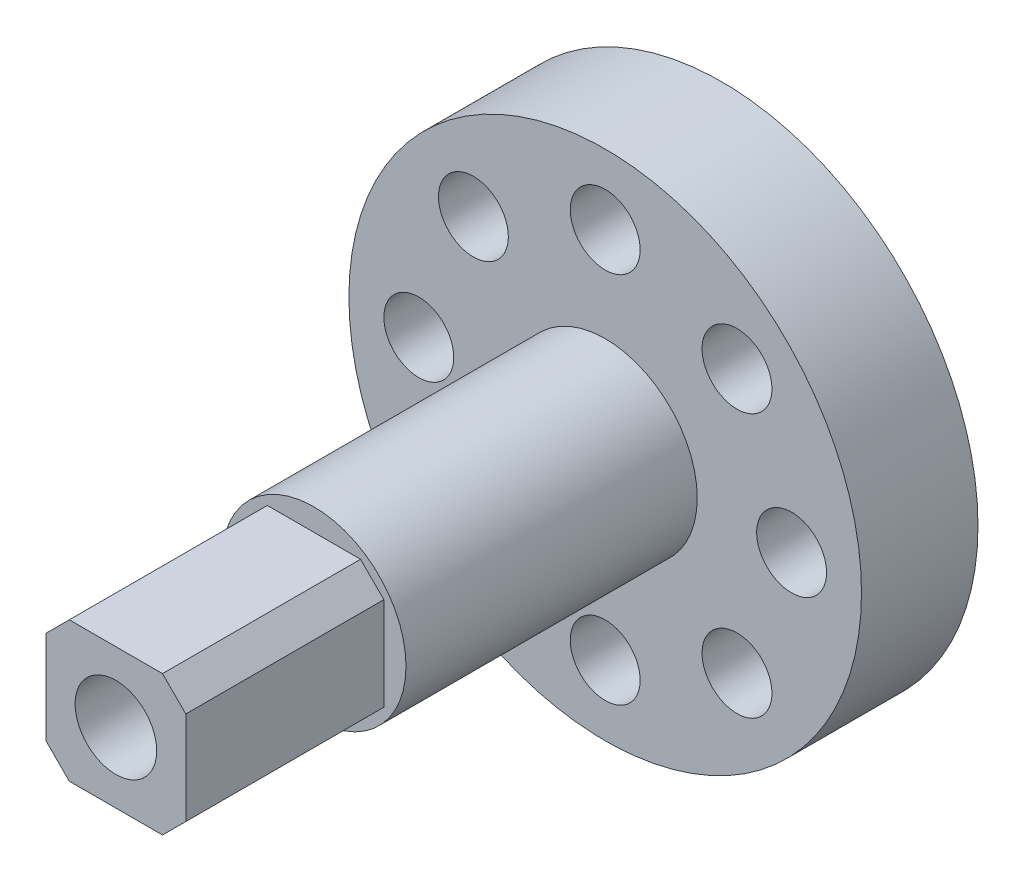
ISO-10303-21;
HEADER;
FILE_DESCRIPTION(('STEP AP214'),'2;1');
FILE_NAME('part.step','',(''),(''),'','','');
FILE_SCHEMA(('AUTOMOTIVE_DESIGN { 1 0 10303 214 1 1 1 1 }'));
ENDSEC;
DATA;
#1=APPLICATION_CONTEXT('core data for automotive mechanical design processes');
#2=APPLICATION_PROTOCOL_DEFINITION('international standard','automotive_design',2000,#1);
#3=PRODUCT_CONTEXT('',#1,'mechanical');
#4=PRODUCT('Part','Part','',(#3));
#5=PRODUCT_RELATED_PRODUCT_CATEGORY('part','',(#4));
#6=PRODUCT_DEFINITION_FORMATION('','',#4);
#7=PRODUCT_DEFINITION_CONTEXT('part definition',#1,'design');
#8=PRODUCT_DEFINITION('design','',#6,#7);
#9=PRODUCT_DEFINITION_SHAPE('','',#8);
#10=(LENGTH_UNIT() NAMED_UNIT(*) SI_UNIT(.MILLI.,.METRE.));
#11=(NAMED_UNIT(*) PLANE_ANGLE_UNIT() SI_UNIT($,.RADIAN.));
#12=(NAMED_UNIT(*) SI_UNIT($,.STERADIAN.) SOLID_ANGLE_UNIT());
#13=UNCERTAINTY_MEASURE_WITH_UNIT(LENGTH_MEASURE(1.E-05),#10,'distance_accuracy_value','');
#14=(GEOMETRIC_REPRESENTATION_CONTEXT(3) GLOBAL_UNCERTAINTY_ASSIGNED_CONTEXT((#13)) GLOBAL_UNIT_ASSIGNED_CONTEXT((#10,
#11,#12)) REPRESENTATION_CONTEXT('',''));
#15=CARTESIAN_POINT('',(0.,0.,0.));
#16=DIRECTION('',(0.,0.,1.));
#17=DIRECTION('',(1.,0.,0.));
#18=AXIS2_PLACEMENT_3D('',#15,#16,#17);
#19=CARTESIAN_POINT('',(0.,0.,5.));
#20=DIRECTION('',(0.,0.,1.));
#21=DIRECTION('',(1.,0.,0.));
#22=AXIS2_PLACEMENT_3D('',#19,#20,#21);
#23=PLANE('',#22);
#24=CARTESIAN_POINT('',(0.,0.,5.));
#25=DIRECTION('',(0.,0.,1.));
#26=DIRECTION('',(1.,0.,0.));
#27=AXIS2_PLACEMENT_3D('',#24,#25,#26);
#28=CIRCLE('',#27,3.95);
#29=CARTESIAN_POINT('',(3.95,0.,5.));
#30=VERTEX_POINT('',#29);
#31=EDGE_CURVE('E530',#30,#30,#28,.T.);
#32=ORIENTED_EDGE('',*,*,#31,.F.);
#33=EDGE_LOOP('',(#32));
#34=FACE_BOUND('',#33,.T.);
#35=CARTESIAN_POINT('',(5.65685424949238,-5.65685424949238,5.));
#36=DIRECTION('',(0.,0.,1.));
#37=DIRECTION('',(1.,0.,0.));
#38=AXIS2_PLACEMENT_3D('',#35,#36,#37);
#39=CIRCLE('',#38,1.5);
#40=CARTESIAN_POINT('',(7.15685424949238,-5.65685424949238,5.));
#41=VERTEX_POINT('',#40);
#42=EDGE_CURVE('E172',#41,#41,#39,.T.);
#43=ORIENTED_EDGE('',*,*,#42,.F.);
#44=EDGE_LOOP('',(#43));
#45=FACE_BOUND('',#44,.T.);
#46=CARTESIAN_POINT('',(0.,-8.,5.));
#47=DIRECTION('',(0.,0.,1.));
#48=DIRECTION('',(1.,0.,0.));
#49=AXIS2_PLACEMENT_3D('',#46,#47,#48);
#50=CIRCLE('',#49,1.5);
#51=CARTESIAN_POINT('',(1.5,-8.,5.));
#52=VERTEX_POINT('',#51);
#53=EDGE_CURVE('E202',#52,#52,#50,.T.);
#54=ORIENTED_EDGE('',*,*,#53,.F.);
#55=EDGE_LOOP('',(#54));
#56=FACE_BOUND('',#55,.T.);
#57=CARTESIAN_POINT('',(-5.65685424949238,-5.65685424949238,5.));
#58=DIRECTION('',(0.,0.,1.));
#59=DIRECTION('',(1.,0.,0.));
#60=AXIS2_PLACEMENT_3D('',#57,#58,#59);
#61=CIRCLE('',#60,1.5);
#62=CARTESIAN_POINT('',(-4.15685424949238,-5.65685424949238,5.));
#63=VERTEX_POINT('',#62);
#64=EDGE_CURVE('E199',#63,#63,#61,.T.);
#65=ORIENTED_EDGE('',*,*,#64,.F.);
#66=EDGE_LOOP('',(#65));
#67=FACE_BOUND('',#66,.T.);
#68=CARTESIAN_POINT('',(-8.,0.,5.));
#69=DIRECTION('',(0.,0.,1.));
#70=DIRECTION('',(1.,0.,0.));
#71=AXIS2_PLACEMENT_3D('',#68,#69,#70);
#72=CIRCLE('',#71,1.5);
#73=CARTESIAN_POINT('',(-6.5,0.,5.));
#74=VERTEX_POINT('',#73);
#75=EDGE_CURVE('E196',#74,#74,#72,.T.);
#76=ORIENTED_EDGE('',*,*,#75,.F.);
#77=EDGE_LOOP('',(#76));
#78=FACE_BOUND('',#77,.T.);
#79=CARTESIAN_POINT('',(-5.65685424949238,5.65685424949238,5.));
#80=DIRECTION('',(0.,0.,1.));
#81=DIRECTION('',(1.,0.,0.));
#82=AXIS2_PLACEMENT_3D('',#79,#80,#81);
#83=CIRCLE('',#82,1.5);
#84=CARTESIAN_POINT('',(-4.15685424949238,5.65685424949238,5.));
#85=VERTEX_POINT('',#84);
#86=EDGE_CURVE('E193',#85,#85,#83,.T.);
#87=ORIENTED_EDGE('',*,*,#86,.F.);
#88=EDGE_LOOP('',(#87));
#89=FACE_BOUND('',#88,.T.);
#90=CARTESIAN_POINT('',(0.,8.,5.));
#91=DIRECTION('',(0.,0.,1.));
#92=DIRECTION('',(1.,0.,0.));
#93=AXIS2_PLACEMENT_3D('',#90,#91,#92);
#94=CIRCLE('',#93,1.5);
#95=CARTESIAN_POINT('',(1.5,8.,5.));
#96=VERTEX_POINT('',#95);
#97=EDGE_CURVE('E190',#96,#96,#94,.T.);
#98=ORIENTED_EDGE('',*,*,#97,.F.);
#99=EDGE_LOOP('',(#98));
#100=FACE_BOUND('',#99,.T.);
#101=CARTESIAN_POINT('',(5.65685424949238,5.65685424949238,5.));
#102=DIRECTION('',(0.,0.,1.));
#103=DIRECTION('',(1.,0.,0.));
#104=AXIS2_PLACEMENT_3D('',#101,#102,#103);
#105=CIRCLE('',#104,1.5);
#106=CARTESIAN_POINT('',(7.15685424949238,5.65685424949238,5.));
#107=VERTEX_POINT('',#106);
#108=EDGE_CURVE('E150',#107,#107,#105,.T.);
#109=ORIENTED_EDGE('',*,*,#108,.F.);
#110=EDGE_LOOP('',(#109));
#111=FACE_BOUND('',#110,.T.);
#112=CARTESIAN_POINT('',(8.,0.,5.));
#113=DIRECTION('',(0.,0.,1.));
#114=DIRECTION('',(1.,0.,0.));
#115=AXIS2_PLACEMENT_3D('',#112,#113,#114);
#116=CIRCLE('',#115,1.5);
#117=CARTESIAN_POINT('',(9.5,0.,5.));
#118=VERTEX_POINT('',#117);
#119=EDGE_CURVE('E171',#118,#118,#116,.T.);
#120=ORIENTED_EDGE('',*,*,#119,.F.);
#121=EDGE_LOOP('',(#120));
#122=FACE_BOUND('',#121,.T.);
#123=CARTESIAN_POINT('',(0.,0.,5.));
#124=DIRECTION('',(0.,0.,1.));
#125=DIRECTION('',(1.,0.,0.));
#126=AXIS2_PLACEMENT_3D('',#123,#124,#125);
#127=CIRCLE('',#126,11.);
#128=CARTESIAN_POINT('',(11.,0.,5.));
#129=VERTEX_POINT('',#128);
#130=EDGE_CURVE('E173',#129,#129,#127,.T.);
#131=ORIENTED_EDGE('',*,*,#130,.T.);
#132=EDGE_LOOP('',(#131));
#133=FACE_BOUND('',#132,.T.);
#134=ADVANCED_FACE('F33',(#34,#45,#56,#67,#78,#89,#100,#111,#122,#133),#23,.T.);
#135=CARTESIAN_POINT('',(0.,0.,0.));
#136=DIRECTION('',(0.,0.,1.));
#137=DIRECTION('',(1.,0.,0.));
#138=AXIS2_PLACEMENT_3D('',#135,#136,#137);
#139=PLANE('',#138);
#140=CARTESIAN_POINT('',(5.65685424949238,-5.65685424949238,0.));
#141=DIRECTION('',(0.,0.,1.));
#142=DIRECTION('',(1.,0.,0.));
#143=AXIS2_PLACEMENT_3D('',#140,#141,#142);
#144=CIRCLE('',#143,1.5);
#145=CARTESIAN_POINT('',(7.15685424949238,-5.65685424949238,0.));
#146=VERTEX_POINT('',#145);
#147=EDGE_CURVE('E147',#146,#146,#144,.T.);
#148=ORIENTED_EDGE('',*,*,#147,.T.);
#149=EDGE_LOOP('',(#148));
#150=FACE_BOUND('',#149,.T.);
#151=CARTESIAN_POINT('',(0.,-8.,0.));
#152=DIRECTION('',(0.,0.,1.));
#153=DIRECTION('',(1.,0.,0.));
#154=AXIS2_PLACEMENT_3D('',#151,#152,#153);
#155=CIRCLE('',#154,1.5);
#156=CARTESIAN_POINT('',(1.5,-8.,0.));
#157=VERTEX_POINT('',#156);
#158=EDGE_CURVE('E151',#157,#157,#155,.T.);
#159=ORIENTED_EDGE('',*,*,#158,.T.);
#160=EDGE_LOOP('',(#159));
#161=FACE_BOUND('',#160,.T.);
#162=CARTESIAN_POINT('',(-5.65685424949238,-5.65685424949238,0.));
#163=DIRECTION('',(0.,0.,1.));
#164=DIRECTION('',(1.,0.,0.));
#165=AXIS2_PLACEMENT_3D('',#162,#163,#164);
#166=CIRCLE('',#165,1.5);
#167=CARTESIAN_POINT('',(-4.15685424949238,-5.65685424949238,0.));
#168=VERTEX_POINT('',#167);
#169=EDGE_CURVE('E154',#168,#168,#166,.T.);
#170=ORIENTED_EDGE('',*,*,#169,.T.);
#171=EDGE_LOOP('',(#170));
#172=FACE_BOUND('',#171,.T.);
#173=CARTESIAN_POINT('',(-8.,0.,0.));
#174=DIRECTION('',(0.,0.,1.));
#175=DIRECTION('',(1.,0.,0.));
#176=AXIS2_PLACEMENT_3D('',#173,#174,#175);
#177=CIRCLE('',#176,1.5);
#178=CARTESIAN_POINT('',(-6.5,0.,0.));
#179=VERTEX_POINT('',#178);
#180=EDGE_CURVE('E157',#179,#179,#177,.T.);
#181=ORIENTED_EDGE('',*,*,#180,.T.);
#182=EDGE_LOOP('',(#181));
#183=FACE_BOUND('',#182,.T.);
#184=CARTESIAN_POINT('',(-5.65685424949238,5.65685424949238,0.));
#185=DIRECTION('',(0.,0.,1.));
#186=DIRECTION('',(1.,0.,0.));
#187=AXIS2_PLACEMENT_3D('',#184,#185,#186);
#188=CIRCLE('',#187,1.5);
#189=CARTESIAN_POINT('',(-4.15685424949238,5.65685424949238,0.));
#190=VERTEX_POINT('',#189);
#191=EDGE_CURVE('E160',#190,#190,#188,.T.);
#192=ORIENTED_EDGE('',*,*,#191,.T.);
#193=EDGE_LOOP('',(#192));
#194=FACE_BOUND('',#193,.T.);
#195=CARTESIAN_POINT('',(0.,8.,0.));
#196=DIRECTION('',(0.,0.,1.));
#197=DIRECTION('',(1.,0.,0.));
#198=AXIS2_PLACEMENT_3D('',#195,#196,#197);
#199=CIRCLE('',#198,1.5);
#200=CARTESIAN_POINT('',(1.5,8.,0.));
#201=VERTEX_POINT('',#200);
#202=EDGE_CURVE('E163',#201,#201,#199,.T.);
#203=ORIENTED_EDGE('',*,*,#202,.T.);
#204=EDGE_LOOP('',(#203));
#205=FACE_BOUND('',#204,.T.);
#206=CARTESIAN_POINT('',(5.65685424949238,5.65685424949238,0.));
#207=DIRECTION('',(0.,0.,1.));
#208=DIRECTION('',(1.,0.,0.));
#209=AXIS2_PLACEMENT_3D('',#206,#207,#208);
#210=CIRCLE('',#209,1.5);
#211=CARTESIAN_POINT('',(7.15685424949238,5.65685424949238,0.));
#212=VERTEX_POINT('',#211);
#213=EDGE_CURVE('E146',#212,#212,#210,.T.);
#214=ORIENTED_EDGE('',*,*,#213,.T.);
#215=EDGE_LOOP('',(#214));
#216=FACE_BOUND('',#215,.T.);
#217=CARTESIAN_POINT('',(8.,0.,0.));
#218=DIRECTION('',(0.,0.,1.));
#219=DIRECTION('',(1.,0.,0.));
#220=AXIS2_PLACEMENT_3D('',#217,#218,#219);
#221=CIRCLE('',#220,1.5);
#222=CARTESIAN_POINT('',(9.5,0.,0.));
#223=VERTEX_POINT('',#222);
#224=EDGE_CURVE('E168',#223,#223,#221,.T.);
#225=ORIENTED_EDGE('',*,*,#224,.T.);
#226=EDGE_LOOP('',(#225));
#227=FACE_BOUND('',#226,.T.);
#228=CARTESIAN_POINT('',(0.,0.,0.));
#229=DIRECTION('',(0.,0.,1.));
#230=DIRECTION('',(1.,0.,0.));
#231=AXIS2_PLACEMENT_3D('',#228,#229,#230);
#232=CIRCLE('',#231,11.);
#233=CARTESIAN_POINT('',(11.,0.,0.));
#234=VERTEX_POINT('',#233);
#235=EDGE_CURVE('E182',#234,#234,#232,.T.);
#236=ORIENTED_EDGE('',*,*,#235,.F.);
#237=EDGE_LOOP('',(#236));
#238=FACE_BOUND('',#237,.T.);
#239=CARTESIAN_POINT('',(0.,0.,0.));
#240=DIRECTION('',(0.,0.,1.));
#241=DIRECTION('',(1.,0.,0.));
#242=AXIS2_PLACEMENT_3D('',#239,#240,#241);
#243=CIRCLE('',#242,4.5);
#244=CARTESIAN_POINT('',(4.5,0.,0.));
#245=VERTEX_POINT('',#244);
#246=EDGE_CURVE('E179',#245,#245,#243,.T.);
#247=ORIENTED_EDGE('',*,*,#246,.T.);
#248=EDGE_LOOP('',(#247));
#249=FACE_BOUND('',#248,.T.);
#250=ADVANCED_FACE('F258',(#150,#161,#172,#183,#194,#205,#216,#227,#238,#249),#139,.F.);
#251=CARTESIAN_POINT('',(0.,0.,4.));
#252=DIRECTION('',(0.,0.,-1.));
#253=DIRECTION('',(-1.,0.,0.));
#254=AXIS2_PLACEMENT_3D('',#251,#252,#253);
#255=CYLINDRICAL_SURFACE('',#254,11.);
#256=ORIENTED_EDGE('',*,*,#235,.T.);
#257=EDGE_LOOP('',(#256));
#258=FACE_BOUND('',#257,.T.);
#259=ORIENTED_EDGE('',*,*,#130,.F.);
#260=EDGE_LOOP('',(#259));
#261=FACE_BOUND('',#260,.T.);
#262=ADVANCED_FACE('F264',(#258,#261),#255,.T.);
#263=CARTESIAN_POINT('',(0.,0.,4.));
#264=DIRECTION('',(0.,0.,-1.));
#265=DIRECTION('',(-1.,0.,0.));
#266=AXIS2_PLACEMENT_3D('',#263,#264,#265);
#267=CYLINDRICAL_SURFACE('',#266,4.5);
#268=CARTESIAN_POINT('',(0.,0.,4.));
#269=DIRECTION('',(0.,0.,1.));
#270=DIRECTION('',(1.,0.,0.));
#271=AXIS2_PLACEMENT_3D('',#268,#269,#270);
#272=CIRCLE('',#271,4.5);
#273=CARTESIAN_POINT('',(4.5,0.,4.));
#274=VERTEX_POINT('',#273);
#275=EDGE_CURVE('E176',#274,#274,#272,.T.);
#276=ORIENTED_EDGE('',*,*,#275,.T.);
#277=EDGE_LOOP('',(#276));
#278=FACE_BOUND('',#277,.T.);
#279=ORIENTED_EDGE('',*,*,#246,.F.);
#280=EDGE_LOOP('',(#279));
#281=FACE_BOUND('',#280,.T.);
#282=ADVANCED_FACE('F276',(#278,#281),#267,.F.);
#283=CARTESIAN_POINT('',(0.,0.,4.));
#284=DIRECTION('',(0.,0.,1.));
#285=DIRECTION('',(1.,0.,0.));
#286=AXIS2_PLACEMENT_3D('',#283,#284,#285);
#287=PLANE('',#286);
#288=CARTESIAN_POINT('',(0.,0.,4.));
#289=DIRECTION('',(0.,0.,1.));
#290=DIRECTION('',(1.,0.,0.));
#291=AXIS2_PLACEMENT_3D('',#288,#289,#290);
#292=CIRCLE('',#291,1.75);
#293=CARTESIAN_POINT('',(1.75,0.,4.));
#294=VERTEX_POINT('',#293);
#295=EDGE_CURVE('E531',#294,#294,#292,.T.);
#296=ORIENTED_EDGE('',*,*,#295,.T.);
#297=EDGE_LOOP('',(#296));
#298=FACE_BOUND('',#297,.T.);
#299=ORIENTED_EDGE('',*,*,#275,.F.);
#300=EDGE_LOOP('',(#299));
#301=FACE_BOUND('',#300,.T.);
#302=ADVANCED_FACE('F273',(#298,#301),#287,.F.);
#303=CARTESIAN_POINT('',(8.,0.,0.));
#304=DIRECTION('',(0.,0.,1.));
#305=DIRECTION('',(1.,0.,0.));
#306=AXIS2_PLACEMENT_3D('',#303,#304,#305);
#307=CYLINDRICAL_SURFACE('',#306,1.5);
#308=ORIENTED_EDGE('',*,*,#119,.T.);
#309=EDGE_LOOP('',(#308));
#310=FACE_BOUND('',#309,.T.);
#311=ORIENTED_EDGE('',*,*,#224,.F.);
#312=EDGE_LOOP('',(#311));
#313=FACE_BOUND('',#312,.T.);
#314=ADVANCED_FACE('F271',(#310,#313),#307,.F.);
#315=CARTESIAN_POINT('',(5.65685424949238,5.65685424949238,0.));
#316=DIRECTION('',(0.,0.,1.));
#317=DIRECTION('',(1.,0.,0.));
#318=AXIS2_PLACEMENT_3D('',#315,#316,#317);
#319=CYLINDRICAL_SURFACE('',#318,1.5);
#320=ORIENTED_EDGE('',*,*,#108,.T.);
#321=EDGE_LOOP('',(#320));
#322=FACE_BOUND('',#321,.T.);
#323=ORIENTED_EDGE('',*,*,#213,.F.);
#324=EDGE_LOOP('',(#323));
#325=FACE_BOUND('',#324,.T.);
#326=ADVANCED_FACE('F440',(#322,#325),#319,.F.);
#327=CARTESIAN_POINT('',(0.,8.,0.));
#328=DIRECTION('',(0.,0.,1.));
#329=DIRECTION('',(1.,0.,0.));
#330=AXIS2_PLACEMENT_3D('',#327,#328,#329);
#331=CYLINDRICAL_SURFACE('',#330,1.5);
#332=ORIENTED_EDGE('',*,*,#97,.T.);
#333=EDGE_LOOP('',(#332));
#334=FACE_BOUND('',#333,.T.);
#335=ORIENTED_EDGE('',*,*,#202,.F.);
#336=EDGE_LOOP('',(#335));
#337=FACE_BOUND('',#336,.T.);
#338=ADVANCED_FACE('F430',(#334,#337),#331,.F.);
#339=CARTESIAN_POINT('',(-5.65685424949238,5.65685424949238,0.));
#340=DIRECTION('',(0.,0.,1.));
#341=DIRECTION('',(1.,0.,0.));
#342=AXIS2_PLACEMENT_3D('',#339,#340,#341);
#343=CYLINDRICAL_SURFACE('',#342,1.5);
#344=ORIENTED_EDGE('',*,*,#86,.T.);
#345=EDGE_LOOP('',(#344));
#346=FACE_BOUND('',#345,.T.);
#347=ORIENTED_EDGE('',*,*,#191,.F.);
#348=EDGE_LOOP('',(#347));
#349=FACE_BOUND('',#348,.T.);
#350=ADVANCED_FACE('F420',(#346,#349),#343,.F.);
#351=CARTESIAN_POINT('',(-8.,0.,0.));
#352=DIRECTION('',(0.,0.,1.));
#353=DIRECTION('',(1.,0.,0.));
#354=AXIS2_PLACEMENT_3D('',#351,#352,#353);
#355=CYLINDRICAL_SURFACE('',#354,1.5);
#356=ORIENTED_EDGE('',*,*,#75,.T.);
#357=EDGE_LOOP('',(#356));
#358=FACE_BOUND('',#357,.T.);
#359=ORIENTED_EDGE('',*,*,#180,.F.);
#360=EDGE_LOOP('',(#359));
#361=FACE_BOUND('',#360,.T.);
#362=ADVANCED_FACE('F410',(#358,#361),#355,.F.);
#363=CARTESIAN_POINT('',(-5.65685424949238,-5.65685424949238,0.));
#364=DIRECTION('',(0.,0.,1.));
#365=DIRECTION('',(1.,0.,0.));
#366=AXIS2_PLACEMENT_3D('',#363,#364,#365);
#367=CYLINDRICAL_SURFACE('',#366,1.5);
#368=ORIENTED_EDGE('',*,*,#64,.T.);
#369=EDGE_LOOP('',(#368));
#370=FACE_BOUND('',#369,.T.);
#371=ORIENTED_EDGE('',*,*,#169,.F.);
#372=EDGE_LOOP('',(#371));
#373=FACE_BOUND('',#372,.T.);
#374=ADVANCED_FACE('F400',(#370,#373),#367,.F.);
#375=CARTESIAN_POINT('',(0.,-8.,0.));
#376=DIRECTION('',(0.,0.,1.));
#377=DIRECTION('',(1.,0.,0.));
#378=AXIS2_PLACEMENT_3D('',#375,#376,#377);
#379=CYLINDRICAL_SURFACE('',#378,1.5);
#380=ORIENTED_EDGE('',*,*,#53,.T.);
#381=EDGE_LOOP('',(#380));
#382=FACE_BOUND('',#381,.T.);
#383=ORIENTED_EDGE('',*,*,#158,.F.);
#384=EDGE_LOOP('',(#383));
#385=FACE_BOUND('',#384,.T.);
#386=ADVANCED_FACE('F391',(#382,#385),#379,.F.);
#387=CARTESIAN_POINT('',(5.65685424949238,-5.65685424949238,0.));
#388=DIRECTION('',(0.,0.,1.));
#389=DIRECTION('',(1.,0.,0.));
#390=AXIS2_PLACEMENT_3D('',#387,#388,#389);
#391=CYLINDRICAL_SURFACE('',#390,1.5);
#392=ORIENTED_EDGE('',*,*,#42,.T.);
#393=EDGE_LOOP('',(#392));
#394=FACE_BOUND('',#393,.T.);
#395=ORIENTED_EDGE('',*,*,#147,.F.);
#396=EDGE_LOOP('',(#395));
#397=FACE_BOUND('',#396,.T.);
#398=ADVANCED_FACE('F359',(#394,#397),#391,.F.);
#399=CARTESIAN_POINT('',(0.,0.,17.5));
#400=DIRECTION('',(0.,0.,-1.));
#401=DIRECTION('',(-1.,0.,0.));
#402=AXIS2_PLACEMENT_3D('',#399,#400,#401);
#403=CYLINDRICAL_SURFACE('',#402,3.95);
#404=CARTESIAN_POINT('',(0.,0.,17.5));
#405=DIRECTION('',(0.,0.,1.));
#406=DIRECTION('',(1.,0.,0.));
#407=AXIS2_PLACEMENT_3D('',#404,#405,#406);
#408=CIRCLE('',#407,3.95);
#409=CARTESIAN_POINT('',(3.95,0.,17.5));
#410=VERTEX_POINT('',#409);
#411=EDGE_CURVE('E116',#410,#410,#408,.T.);
#412=ORIENTED_EDGE('',*,*,#411,.F.);
#413=EDGE_LOOP('',(#412));
#414=FACE_BOUND('',#413,.T.);
#415=ORIENTED_EDGE('',*,*,#31,.T.);
#416=EDGE_LOOP('',(#415));
#417=FACE_BOUND('',#416,.T.);
#418=ADVANCED_FACE('F301',(#414,#417),#403,.T.);
#419=CARTESIAN_POINT('',(0.,0.,17.5));
#420=DIRECTION('',(0.,0.,1.));
#421=DIRECTION('',(1.,0.,0.));
#422=AXIS2_PLACEMENT_3D('',#419,#420,#421);
#423=PLANE('',#422);
#424=DIRECTION('',(0.,1.,0.));
#425=VECTOR('',#424,1.);
#426=CARTESIAN_POINT('',(3.,3.,17.5));
#427=LINE('',#426,#425);
#428=CARTESIAN_POINT('',(3.,-2.00000000000001,17.5));
#429=VERTEX_POINT('',#428);
#430=CARTESIAN_POINT('',(3.,2.,17.5));
#431=VERTEX_POINT('',#430);
#432=EDGE_CURVE('E128',#429,#431,#427,.T.);
#433=ORIENTED_EDGE('',*,*,#432,.F.);
#434=DIRECTION('',(0.707106781186549,0.707106781186546,0.));
#435=VECTOR('',#434,1.);
#436=CARTESIAN_POINT('',(3.,-2.00000000000001,17.5));
#437=LINE('',#436,#435);
#438=CARTESIAN_POINT('',(2.,-3.,17.5));
#439=VERTEX_POINT('',#438);
#440=EDGE_CURVE('E132',#429,#439,#437,.F.);
#441=ORIENTED_EDGE('',*,*,#440,.T.);
#442=DIRECTION('',(1.,0.,0.));
#443=VECTOR('',#442,1.);
#444=CARTESIAN_POINT('',(-3.,-3.,17.5));
#445=LINE('',#444,#443);
#446=CARTESIAN_POINT('',(-2.00000000000001,-3.,17.5));
#447=VERTEX_POINT('',#446);
#448=EDGE_CURVE('E130',#447,#439,#445,.T.);
#449=ORIENTED_EDGE('',*,*,#448,.F.);
#450=DIRECTION('',(0.707106781186546,-0.707106781186549,0.));
#451=VECTOR('',#450,1.);
#452=CARTESIAN_POINT('',(-2.00000000000001,-3.,17.5));
#453=LINE('',#452,#451);
#454=CARTESIAN_POINT('',(-3.,-2.,17.5));
#455=VERTEX_POINT('',#454);
#456=EDGE_CURVE('E49',#447,#455,#453,.F.);
#457=ORIENTED_EDGE('',*,*,#456,.T.);
#458=DIRECTION('',(0.,-1.,0.));
#459=VECTOR('',#458,1.);
#460=CARTESIAN_POINT('',(-3.,3.,17.5));
#461=LINE('',#460,#459);
#462=CARTESIAN_POINT('',(-3.,2.00000000000001,17.5));
#463=VERTEX_POINT('',#462);
#464=EDGE_CURVE('E57',#463,#455,#461,.T.);
#465=ORIENTED_EDGE('',*,*,#464,.F.);
#466=DIRECTION('',(-0.707106781186549,-0.707106781186546,0.));
#467=VECTOR('',#466,1.);
#468=CARTESIAN_POINT('',(-3.,2.00000000000001,17.5));
#469=LINE('',#468,#467);
#470=CARTESIAN_POINT('',(-2.,3.,17.5));
#471=VERTEX_POINT('',#470);
#472=EDGE_CURVE('E11',#463,#471,#469,.F.);
#473=ORIENTED_EDGE('',*,*,#472,.T.);
#474=DIRECTION('',(-1.,0.,0.));
#475=VECTOR('',#474,1.);
#476=CARTESIAN_POINT('',(-3.,3.,17.5));
#477=LINE('',#476,#475);
#478=CARTESIAN_POINT('',(2.00000000000001,3.,17.5));
#479=VERTEX_POINT('',#478);
#480=EDGE_CURVE('E111',#479,#471,#477,.T.);
#481=ORIENTED_EDGE('',*,*,#480,.F.);
#482=DIRECTION('',(-0.707106781186547,0.707106781186548,0.));
#483=VECTOR('',#482,1.);
#484=CARTESIAN_POINT('',(2.00000000000001,3.,17.5));
#485=LINE('',#484,#483);
#486=EDGE_CURVE('E122',#479,#431,#485,.F.);
#487=ORIENTED_EDGE('',*,*,#486,.T.);
#488=EDGE_LOOP('',(#433,#441,#449,#457,#465,#473,#481,#487));
#489=FACE_BOUND('',#488,.T.);
#490=ORIENTED_EDGE('',*,*,#411,.T.);
#491=EDGE_LOOP('',(#490));
#492=FACE_BOUND('',#491,.T.);
#493=ADVANCED_FACE('F119',(#489,#492),#423,.T.);
#494=CARTESIAN_POINT('',(0.,0.,26.));
#495=DIRECTION('',(0.,0.,1.));
#496=DIRECTION('',(1.,0.,0.));
#497=AXIS2_PLACEMENT_3D('',#494,#495,#496);
#498=PLANE('',#497);
#499=CARTESIAN_POINT('',(0.,0.,26.));
#500=DIRECTION('',(0.,0.,1.));
#501=DIRECTION('',(1.,0.,0.));
#502=AXIS2_PLACEMENT_3D('',#499,#500,#501);
#503=CIRCLE('',#502,1.75);
#504=CARTESIAN_POINT('',(1.75,0.,26.));
#505=VERTEX_POINT('',#504);
#506=EDGE_CURVE('E37',#505,#505,#503,.T.);
#507=ORIENTED_EDGE('',*,*,#506,.F.);
#508=EDGE_LOOP('',(#507));
#509=FACE_BOUND('',#508,.T.);
#510=DIRECTION('',(0.,-1.,0.));
#511=VECTOR('',#510,1.);
#512=CARTESIAN_POINT('',(-3.,3.,26.));
#513=LINE('',#512,#511);
#514=CARTESIAN_POINT('',(-3.,2.00000000000001,26.));
#515=VERTEX_POINT('',#514);
#516=CARTESIAN_POINT('',(-3.,-2.,26.));
#517=VERTEX_POINT('',#516);
#518=EDGE_CURVE('E135',#515,#517,#513,.T.);
#519=ORIENTED_EDGE('',*,*,#518,.T.);
#520=DIRECTION('',(-0.707106781186546,0.707106781186549,0.));
#521=VECTOR('',#520,1.);
#522=CARTESIAN_POINT('',(-2.50000000000001,-2.5,26.));
#523=LINE('',#522,#521);
#524=CARTESIAN_POINT('',(-2.00000000000001,-3.,26.));
#525=VERTEX_POINT('',#524);
#526=EDGE_CURVE('E219',#517,#525,#523,.F.);
#527=ORIENTED_EDGE('',*,*,#526,.T.);
#528=DIRECTION('',(1.,0.,0.));
#529=VECTOR('',#528,1.);
#530=CARTESIAN_POINT('',(-3.,-3.,26.));
#531=LINE('',#530,#529);
#532=CARTESIAN_POINT('',(2.,-3.,26.));
#533=VERTEX_POINT('',#532);
#534=EDGE_CURVE('E138',#525,#533,#531,.T.);
#535=ORIENTED_EDGE('',*,*,#534,.T.);
#536=DIRECTION('',(-0.707106781186549,-0.707106781186546,0.));
#537=VECTOR('',#536,1.);
#538=CARTESIAN_POINT('',(2.5,-2.50000000000001,26.));
#539=LINE('',#538,#537);
#540=CARTESIAN_POINT('',(3.,-2.00000000000001,26.));
#541=VERTEX_POINT('',#540);
#542=EDGE_CURVE('E217',#533,#541,#539,.F.);
#543=ORIENTED_EDGE('',*,*,#542,.T.);
#544=DIRECTION('',(0.,1.,0.));
#545=VECTOR('',#544,1.);
#546=CARTESIAN_POINT('',(3.,3.,26.));
#547=LINE('',#546,#545);
#548=CARTESIAN_POINT('',(3.,2.,26.));
#549=VERTEX_POINT('',#548);
#550=EDGE_CURVE('E141',#541,#549,#547,.T.);
#551=ORIENTED_EDGE('',*,*,#550,.T.);
#552=DIRECTION('',(0.707106781186547,-0.707106781186548,0.));
#553=VECTOR('',#552,1.);
#554=CARTESIAN_POINT('',(2.5,2.5,26.));
#555=LINE('',#554,#553);
#556=CARTESIAN_POINT('',(2.00000000000001,3.,26.));
#557=VERTEX_POINT('',#556);
#558=EDGE_CURVE('E215',#549,#557,#555,.F.);
#559=ORIENTED_EDGE('',*,*,#558,.T.);
#560=DIRECTION('',(-1.,0.,0.));
#561=VECTOR('',#560,1.);
#562=CARTESIAN_POINT('',(-3.,3.,26.));
#563=LINE('',#562,#561);
#564=CARTESIAN_POINT('',(-2.,3.,26.));
#565=VERTEX_POINT('',#564);
#566=EDGE_CURVE('E144',#557,#565,#563,.T.);
#567=ORIENTED_EDGE('',*,*,#566,.T.);
#568=DIRECTION('',(0.707106781186549,0.707106781186546,0.));
#569=VECTOR('',#568,1.);
#570=CARTESIAN_POINT('',(-2.5,2.50000000000001,26.));
#571=LINE('',#570,#569);
#572=EDGE_CURVE('E103',#565,#515,#571,.F.);
#573=ORIENTED_EDGE('',*,*,#572,.T.);
#574=EDGE_LOOP('',(#519,#527,#535,#543,#551,#559,#567,#573));
#575=FACE_BOUND('',#574,.T.);
#576=ADVANCED_FACE('F236',(#509,#575),#498,.T.);
#577=CARTESIAN_POINT('',(-3.,2.00000000000001,26.));
#578=DIRECTION('',(0.707106781186546,-0.707106781186549,0.));
#579=DIRECTION('',(0.,0.,-1.));
#580=AXIS2_PLACEMENT_3D('',#577,#578,#579);
#581=PLANE('',#580);
#582=ORIENTED_EDGE('',*,*,#472,.F.);
#583=DIRECTION('',(0.,0.,-1.));
#584=VECTOR('',#583,1.);
#585=CARTESIAN_POINT('',(-3.,2.00000000000001,26.));
#586=LINE('',#585,#584);
#587=EDGE_CURVE('E210',#515,#463,#586,.T.);
#588=ORIENTED_EDGE('',*,*,#587,.F.);
#589=ORIENTED_EDGE('',*,*,#572,.F.);
#590=DIRECTION('',(0.,0.,1.));
#591=VECTOR('',#590,1.);
#592=CARTESIAN_POINT('',(-2.,3.,26.));
#593=LINE('',#592,#591);
#594=EDGE_CURVE('E100',#471,#565,#593,.T.);
#595=ORIENTED_EDGE('',*,*,#594,.F.);
#596=EDGE_LOOP('',(#582,#588,#589,#595));
#597=FACE_BOUND('',#596,.T.);
#598=ADVANCED_FACE('F35',(#597),#581,.F.);
#599=CARTESIAN_POINT('',(2.00000000000001,3.,26.));
#600=DIRECTION('',(-0.707106781186548,-0.707106781186547,0.));
#601=DIRECTION('',(0.,0.,-1.));
#602=AXIS2_PLACEMENT_3D('',#599,#600,#601);
#603=PLANE('',#602);
#604=ORIENTED_EDGE('',*,*,#486,.F.);
#605=DIRECTION('',(0.,0.,-1.));
#606=VECTOR('',#605,1.);
#607=CARTESIAN_POINT('',(2.00000000000001,3.,26.));
#608=LINE('',#607,#606);
#609=EDGE_CURVE('E42',#557,#479,#608,.T.);
#610=ORIENTED_EDGE('',*,*,#609,.F.);
#611=ORIENTED_EDGE('',*,*,#558,.F.);
#612=DIRECTION('',(0.,0.,1.));
#613=VECTOR('',#612,1.);
#614=CARTESIAN_POINT('',(3.,2.,26.));
#615=LINE('',#614,#613);
#616=EDGE_CURVE('E221',#431,#549,#615,.T.);
#617=ORIENTED_EDGE('',*,*,#616,.F.);
#618=EDGE_LOOP('',(#604,#610,#611,#617));
#619=FACE_BOUND('',#618,.T.);
#620=ADVANCED_FACE('F233',(#619),#603,.F.);
#621=CARTESIAN_POINT('',(-3.,3.,26.));
#622=DIRECTION('',(0.,-1.,0.));
#623=DIRECTION('',(0.,0.,-1.));
#624=AXIS2_PLACEMENT_3D('',#621,#622,#623);
#625=PLANE('',#624);
#626=ORIENTED_EDGE('',*,*,#609,.T.);
#627=ORIENTED_EDGE('',*,*,#480,.T.);
#628=ORIENTED_EDGE('',*,*,#594,.T.);
#629=ORIENTED_EDGE('',*,*,#566,.F.);
#630=EDGE_LOOP('',(#626,#627,#628,#629));
#631=FACE_BOUND('',#630,.T.);
#632=ADVANCED_FACE('F112',(#631),#625,.F.);
#633=CARTESIAN_POINT('',(3.,-2.00000000000001,26.));
#634=DIRECTION('',(-0.707106781186546,0.707106781186549,0.));
#635=DIRECTION('',(0.,0.,-1.));
#636=AXIS2_PLACEMENT_3D('',#633,#634,#635);
#637=PLANE('',#636);
#638=ORIENTED_EDGE('',*,*,#440,.F.);
#639=DIRECTION('',(0.,0.,-1.));
#640=VECTOR('',#639,1.);
#641=CARTESIAN_POINT('',(3.,-2.00000000000001,26.));
#642=LINE('',#641,#640);
#643=EDGE_CURVE('E107',#541,#429,#642,.T.);
#644=ORIENTED_EDGE('',*,*,#643,.F.);
#645=ORIENTED_EDGE('',*,*,#542,.F.);
#646=DIRECTION('',(0.,0.,1.));
#647=VECTOR('',#646,1.);
#648=CARTESIAN_POINT('',(2.,-3.,26.));
#649=LINE('',#648,#647);
#650=EDGE_CURVE('E185',#439,#533,#649,.T.);
#651=ORIENTED_EDGE('',*,*,#650,.F.);
#652=EDGE_LOOP('',(#638,#644,#645,#651));
#653=FACE_BOUND('',#652,.T.);
#654=ADVANCED_FACE('F239',(#653),#637,.F.);
#655=CARTESIAN_POINT('',(3.,3.,26.));
#656=DIRECTION('',(-1.,0.,0.));
#657=DIRECTION('',(0.,0.,1.));
#658=AXIS2_PLACEMENT_3D('',#655,#656,#657);
#659=PLANE('',#658);
#660=ORIENTED_EDGE('',*,*,#643,.T.);
#661=ORIENTED_EDGE('',*,*,#432,.T.);
#662=ORIENTED_EDGE('',*,*,#616,.T.);
#663=ORIENTED_EDGE('',*,*,#550,.F.);
#664=EDGE_LOOP('',(#660,#661,#662,#663));
#665=FACE_BOUND('',#664,.T.);
#666=ADVANCED_FACE('F228',(#665),#659,.F.);
#667=CARTESIAN_POINT('',(-2.00000000000001,-3.,26.));
#668=DIRECTION('',(0.707106781186549,0.707106781186546,0.));
#669=DIRECTION('',(0.,0.,-1.));
#670=AXIS2_PLACEMENT_3D('',#667,#668,#669);
#671=PLANE('',#670);
#672=ORIENTED_EDGE('',*,*,#456,.F.);
#673=DIRECTION('',(0.,0.,-1.));
#674=VECTOR('',#673,1.);
#675=CARTESIAN_POINT('',(-2.00000000000001,-3.,26.));
#676=LINE('',#675,#674);
#677=EDGE_CURVE('E208',#525,#447,#676,.T.);
#678=ORIENTED_EDGE('',*,*,#677,.F.);
#679=ORIENTED_EDGE('',*,*,#526,.F.);
#680=DIRECTION('',(0.,0.,1.));
#681=VECTOR('',#680,1.);
#682=CARTESIAN_POINT('',(-3.,-2.,26.));
#683=LINE('',#682,#681);
#684=EDGE_CURVE('E212',#455,#517,#683,.T.);
#685=ORIENTED_EDGE('',*,*,#684,.F.);
#686=EDGE_LOOP('',(#672,#678,#679,#685));
#687=FACE_BOUND('',#686,.T.);
#688=ADVANCED_FACE('F243',(#687),#671,.F.);
#689=CARTESIAN_POINT('',(-3.,-3.,26.));
#690=DIRECTION('',(0.,1.,0.));
#691=DIRECTION('',(0.,0.,1.));
#692=AXIS2_PLACEMENT_3D('',#689,#690,#691);
#693=PLANE('',#692);
#694=ORIENTED_EDGE('',*,*,#677,.T.);
#695=ORIENTED_EDGE('',*,*,#448,.T.);
#696=ORIENTED_EDGE('',*,*,#650,.T.);
#697=ORIENTED_EDGE('',*,*,#534,.F.);
#698=EDGE_LOOP('',(#694,#695,#696,#697));
#699=FACE_BOUND('',#698,.T.);
#700=ADVANCED_FACE('F241',(#699),#693,.F.);
#701=CARTESIAN_POINT('',(-3.,3.,26.));
#702=DIRECTION('',(1.,0.,0.));
#703=DIRECTION('',(0.,0.,-1.));
#704=AXIS2_PLACEMENT_3D('',#701,#702,#703);
#705=PLANE('',#704);
#706=ORIENTED_EDGE('',*,*,#587,.T.);
#707=ORIENTED_EDGE('',*,*,#464,.T.);
#708=ORIENTED_EDGE('',*,*,#684,.T.);
#709=ORIENTED_EDGE('',*,*,#518,.F.);
#710=EDGE_LOOP('',(#706,#707,#708,#709));
#711=FACE_BOUND('',#710,.T.);
#712=ADVANCED_FACE('F245',(#711),#705,.F.);
#713=CARTESIAN_POINT('',(0.,0.,0.));
#714=DIRECTION('',(0.,0.,1.));
#715=DIRECTION('',(1.,0.,0.));
#716=AXIS2_PLACEMENT_3D('',#713,#714,#715);
#717=CYLINDRICAL_SURFACE('',#716,1.75);
#718=ORIENTED_EDGE('',*,*,#506,.T.);
#719=EDGE_LOOP('',(#718));
#720=FACE_BOUND('',#719,.T.);
#721=ORIENTED_EDGE('',*,*,#295,.F.);
#722=EDGE_LOOP('',(#721));
#723=FACE_BOUND('',#722,.T.);
#724=ADVANCED_FACE('F247',(#720,#723),#717,.F.);
#725=CLOSED_SHELL('',(#134,#250,#262,#282,#302,#314,#326,#338,#350,#362,#374,#386,#398,#418,
#493,#576,#598,#620,#632,#654,#666,#688,#700,#712,#724));
#726=MANIFOLD_SOLID_BREP('B2',#725);
#727=ADVANCED_BREP_SHAPE_REPRESENTATION('',(#18,#726),#14);
#728=SHAPE_DEFINITION_REPRESENTATION(#9,#727);
ENDSEC;
END-ISO-10303-21;
